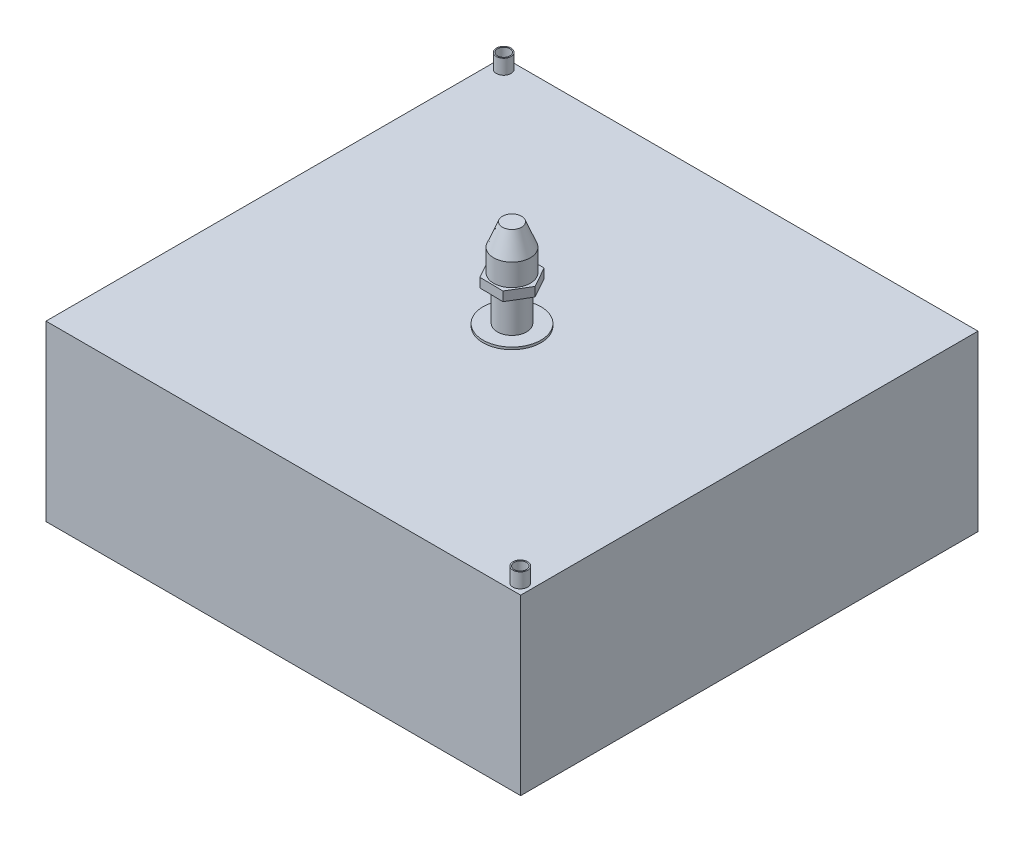
ISO-10303-21;
HEADER;
FILE_DESCRIPTION(('STEP AP214'),'2;1');
FILE_NAME('part.step','',(''),(''),'','','');
FILE_SCHEMA(('AUTOMOTIVE_DESIGN { 1 0 10303 214 1 1 1 1 }'));
ENDSEC;
DATA;
#1=APPLICATION_CONTEXT('core data for automotive mechanical design processes');
#2=APPLICATION_PROTOCOL_DEFINITION('international standard','automotive_design',2000,#1);
#3=PRODUCT_CONTEXT('',#1,'mechanical');
#4=PRODUCT('Part','Part','',(#3));
#5=PRODUCT_RELATED_PRODUCT_CATEGORY('part','',(#4));
#6=PRODUCT_DEFINITION_FORMATION('','',#4);
#7=PRODUCT_DEFINITION_CONTEXT('part definition',#1,'design');
#8=PRODUCT_DEFINITION('design','',#6,#7);
#9=PRODUCT_DEFINITION_SHAPE('','',#8);
#10=(LENGTH_UNIT() NAMED_UNIT(*) SI_UNIT(.MILLI.,.METRE.));
#11=(NAMED_UNIT(*) PLANE_ANGLE_UNIT() SI_UNIT($,.RADIAN.));
#12=(NAMED_UNIT(*) SI_UNIT($,.STERADIAN.) SOLID_ANGLE_UNIT());
#13=UNCERTAINTY_MEASURE_WITH_UNIT(LENGTH_MEASURE(1.E-05),#10,'distance_accuracy_value','');
#14=(GEOMETRIC_REPRESENTATION_CONTEXT(3) GLOBAL_UNCERTAINTY_ASSIGNED_CONTEXT((#13)) GLOBAL_UNIT_ASSIGNED_CONTEXT((#10,
#11,#12)) REPRESENTATION_CONTEXT('',''));
#15=CARTESIAN_POINT('',(0.,0.,0.));
#16=DIRECTION('',(0.,0.,1.));
#17=DIRECTION('',(1.,0.,0.));
#18=AXIS2_PLACEMENT_3D('',#15,#16,#17);
#19=CARTESIAN_POINT('',(0.,152.,0.));
#20=DIRECTION('',(0.,1.,0.));
#21=DIRECTION('',(0.,0.,1.));
#22=AXIS2_PLACEMENT_3D('',#19,#20,#21);
#23=PLANE('',#22);
#24=CARTESIAN_POINT('',(0.,152.,0.));
#25=DIRECTION('',(0.,1.,0.));
#26=DIRECTION('',(0.,0.,1.));
#27=AXIS2_PLACEMENT_3D('',#24,#25,#26);
#28=CIRCLE('',#27,25.);
#29=CARTESIAN_POINT('',(0.,152.,25.));
#30=VERTEX_POINT('',#29);
#31=EDGE_CURVE('E217',#30,#30,#28,.T.);
#32=ORIENTED_EDGE('',*,*,#31,.T.);
#33=EDGE_LOOP('',(#32));
#34=FACE_BOUND('',#33,.T.);
#35=CARTESIAN_POINT('',(0.,152.,0.));
#36=DIRECTION('',(0.,1.,0.));
#37=DIRECTION('',(0.,0.,1.));
#38=AXIS2_PLACEMENT_3D('',#35,#36,#37);
#39=CIRCLE('',#38,12.7);
#40=CARTESIAN_POINT('',(0.,152.,12.7));
#41=VERTEX_POINT('',#40);
#42=EDGE_CURVE('E203',#41,#41,#39,.T.);
#43=ORIENTED_EDGE('',*,*,#42,.F.);
#44=EDGE_LOOP('',(#43));
#45=FACE_BOUND('',#44,.T.);
#46=ADVANCED_FACE('F38',(#34,#45),#23,.T.);
#47=CARTESIAN_POINT('',(-205.,150.,197.5));
#48=DIRECTION('',(0.,-1.,0.));
#49=DIRECTION('',(0.,0.,-1.));
#50=AXIS2_PLACEMENT_3D('',#47,#48,#49);
#51=PLANE('',#50);
#52=CARTESIAN_POINT('',(195.680339288402,150.,188.521302485167));
#53=DIRECTION('',(0.,-1.,0.));
#54=DIRECTION('',(0.,0.,-1.));
#55=AXIS2_PLACEMENT_3D('',#52,#53,#54);
#56=CIRCLE('',#55,6.34999999999999);
#57=CARTESIAN_POINT('',(195.680339288402,150.,182.171302485167));
#58=VERTEX_POINT('',#57);
#59=EDGE_CURVE('E48',#58,#58,#56,.F.);
#60=ORIENTED_EDGE('',*,*,#59,.F.);
#61=EDGE_LOOP('',(#60));
#62=FACE_BOUND('',#61,.T.);
#63=DIRECTION('',(-1.,0.,0.));
#64=VECTOR('',#63,1.);
#65=CARTESIAN_POINT('',(-205.,150.,-197.5));
#66=LINE('',#65,#64);
#67=CARTESIAN_POINT('',(205.,150.,-197.5));
#68=VERTEX_POINT('',#67);
#69=CARTESIAN_POINT('',(-205.,150.,-197.5));
#70=VERTEX_POINT('',#69);
#71=EDGE_CURVE('E85',#68,#70,#66,.T.);
#72=ORIENTED_EDGE('',*,*,#71,.T.);
#73=DIRECTION('',(0.,0.,-1.));
#74=VECTOR('',#73,1.);
#75=CARTESIAN_POINT('',(-205.,150.,197.5));
#76=LINE('',#75,#74);
#77=CARTESIAN_POINT('',(-205.,150.,197.5));
#78=VERTEX_POINT('',#77);
#79=EDGE_CURVE('E296',#78,#70,#76,.T.);
#80=ORIENTED_EDGE('',*,*,#79,.F.);
#81=DIRECTION('',(-1.,0.,0.));
#82=VECTOR('',#81,1.);
#83=CARTESIAN_POINT('',(-205.,150.,197.5));
#84=LINE('',#83,#82);
#85=CARTESIAN_POINT('',(205.,150.,197.5));
#86=VERTEX_POINT('',#85);
#87=EDGE_CURVE('E59',#86,#78,#84,.T.);
#88=ORIENTED_EDGE('',*,*,#87,.F.);
#89=DIRECTION('',(0.,0.,-1.));
#90=VECTOR('',#89,1.);
#91=CARTESIAN_POINT('',(205.,150.,197.5));
#92=LINE('',#91,#90);
#93=EDGE_CURVE('E309',#86,#68,#92,.T.);
#94=ORIENTED_EDGE('',*,*,#93,.T.);
#95=EDGE_LOOP('',(#72,#80,#88,#94));
#96=FACE_BOUND('',#95,.T.);
#97=CARTESIAN_POINT('',(-195.680339288402,150.,-188.521302485167));
#98=DIRECTION('',(0.,-1.,0.));
#99=DIRECTION('',(0.,0.,-1.));
#100=AXIS2_PLACEMENT_3D('',#97,#98,#99);
#101=CIRCLE('',#100,6.34999999999994);
#102=CARTESIAN_POINT('',(-195.680339288402,150.,-194.871302485167));
#103=VERTEX_POINT('',#102);
#104=EDGE_CURVE('E318',#103,#103,#101,.F.);
#105=ORIENTED_EDGE('',*,*,#104,.F.);
#106=EDGE_LOOP('',(#105));
#107=FACE_BOUND('',#106,.T.);
#108=CARTESIAN_POINT('',(0.,150.,0.));
#109=DIRECTION('',(0.,-1.,0.));
#110=DIRECTION('',(0.,0.,-1.));
#111=AXIS2_PLACEMENT_3D('',#108,#109,#110);
#112=CIRCLE('',#111,25.);
#113=CARTESIAN_POINT('',(0.,150.,-25.));
#114=VERTEX_POINT('',#113);
#115=EDGE_CURVE('E11',#114,#114,#112,.F.);
#116=ORIENTED_EDGE('',*,*,#115,.F.);
#117=EDGE_LOOP('',(#116));
#118=FACE_BOUND('',#117,.T.);
#119=ADVANCED_FACE('F326',(#62,#96,#107,#118),#51,.F.);
#120=CARTESIAN_POINT('',(-205.,150.,197.5));
#121=DIRECTION('',(1.,0.,0.));
#122=DIRECTION('',(0.,1.,0.));
#123=AXIS2_PLACEMENT_3D('',#120,#121,#122);
#124=PLANE('',#123);
#125=DIRECTION('',(0.,-1.,0.));
#126=VECTOR('',#125,1.);
#127=CARTESIAN_POINT('',(-205.,150.,-197.5));
#128=LINE('',#127,#126);
#129=CARTESIAN_POINT('',(-205.,0.,-197.5));
#130=VERTEX_POINT('',#129);
#131=EDGE_CURVE('E285',#70,#130,#128,.T.);
#132=ORIENTED_EDGE('',*,*,#131,.T.);
#133=DIRECTION('',(0.,0.,-1.));
#134=VECTOR('',#133,1.);
#135=CARTESIAN_POINT('',(-205.,0.,197.5));
#136=LINE('',#135,#134);
#137=CARTESIAN_POINT('',(-205.,0.,197.5));
#138=VERTEX_POINT('',#137);
#139=EDGE_CURVE('E315',#138,#130,#136,.T.);
#140=ORIENTED_EDGE('',*,*,#139,.F.);
#141=DIRECTION('',(0.,-1.,0.));
#142=VECTOR('',#141,1.);
#143=CARTESIAN_POINT('',(-205.,150.,197.5));
#144=LINE('',#143,#142);
#145=EDGE_CURVE('E286',#78,#138,#144,.T.);
#146=ORIENTED_EDGE('',*,*,#145,.F.);
#147=ORIENTED_EDGE('',*,*,#79,.T.);
#148=EDGE_LOOP('',(#132,#140,#146,#147));
#149=FACE_BOUND('',#148,.T.);
#150=ADVANCED_FACE('F40',(#149),#124,.F.);
#151=CARTESIAN_POINT('',(-205.,0.,197.5));
#152=DIRECTION('',(0.,1.,0.));
#153=DIRECTION('',(0.,0.,1.));
#154=AXIS2_PLACEMENT_3D('',#151,#152,#153);
#155=PLANE('',#154);
#156=DIRECTION('',(1.,0.,0.));
#157=VECTOR('',#156,1.);
#158=CARTESIAN_POINT('',(-205.,0.,-197.5));
#159=LINE('',#158,#157);
#160=CARTESIAN_POINT('',(205.,0.,-197.5));
#161=VERTEX_POINT('',#160);
#162=EDGE_CURVE('E300',#130,#161,#159,.T.);
#163=ORIENTED_EDGE('',*,*,#162,.T.);
#164=DIRECTION('',(0.,0.,-1.));
#165=VECTOR('',#164,1.);
#166=CARTESIAN_POINT('',(205.,0.,197.5));
#167=LINE('',#166,#165);
#168=CARTESIAN_POINT('',(205.,0.,197.5));
#169=VERTEX_POINT('',#168);
#170=EDGE_CURVE('E312',#169,#161,#167,.T.);
#171=ORIENTED_EDGE('',*,*,#170,.F.);
#172=DIRECTION('',(1.,0.,0.));
#173=VECTOR('',#172,1.);
#174=CARTESIAN_POINT('',(-205.,0.,197.5));
#175=LINE('',#174,#173);
#176=EDGE_CURVE('E95',#138,#169,#175,.T.);
#177=ORIENTED_EDGE('',*,*,#176,.F.);
#178=ORIENTED_EDGE('',*,*,#139,.T.);
#179=EDGE_LOOP('',(#163,#171,#177,#178));
#180=FACE_BOUND('',#179,.T.);
#181=ADVANCED_FACE('F664',(#180),#155,.F.);
#182=CARTESIAN_POINT('',(205.,150.,197.5));
#183=DIRECTION('',(-1.,0.,0.));
#184=DIRECTION('',(0.,-1.,0.));
#185=AXIS2_PLACEMENT_3D('',#182,#183,#184);
#186=PLANE('',#185);
#187=DIRECTION('',(0.,1.,0.));
#188=VECTOR('',#187,1.);
#189=CARTESIAN_POINT('',(205.,150.,-197.5));
#190=LINE('',#189,#188);
#191=EDGE_CURVE('E79',#161,#68,#190,.T.);
#192=ORIENTED_EDGE('',*,*,#191,.T.);
#193=ORIENTED_EDGE('',*,*,#93,.F.);
#194=DIRECTION('',(0.,1.,0.));
#195=VECTOR('',#194,1.);
#196=CARTESIAN_POINT('',(205.,150.,197.5));
#197=LINE('',#196,#195);
#198=EDGE_CURVE('E291',#169,#86,#197,.T.);
#199=ORIENTED_EDGE('',*,*,#198,.F.);
#200=ORIENTED_EDGE('',*,*,#170,.T.);
#201=EDGE_LOOP('',(#192,#193,#199,#200));
#202=FACE_BOUND('',#201,.T.);
#203=ADVANCED_FACE('F670',(#202),#186,.F.);
#204=CARTESIAN_POINT('',(-205.,0.,197.5));
#205=DIRECTION('',(0.,0.,1.));
#206=DIRECTION('',(1.,0.,0.));
#207=AXIS2_PLACEMENT_3D('',#204,#205,#206);
#208=PLANE('',#207);
#209=ORIENTED_EDGE('',*,*,#145,.T.);
#210=ORIENTED_EDGE('',*,*,#176,.T.);
#211=ORIENTED_EDGE('',*,*,#198,.T.);
#212=ORIENTED_EDGE('',*,*,#87,.T.);
#213=EDGE_LOOP('',(#209,#210,#211,#212));
#214=FACE_BOUND('',#213,.T.);
#215=ADVANCED_FACE('F675',(#214),#208,.T.);
#216=CARTESIAN_POINT('',(-205.,0.,-197.5));
#217=DIRECTION('',(0.,0.,1.));
#218=DIRECTION('',(1.,0.,0.));
#219=AXIS2_PLACEMENT_3D('',#216,#217,#218);
#220=PLANE('',#219);
#221=ORIENTED_EDGE('',*,*,#131,.F.);
#222=ORIENTED_EDGE('',*,*,#71,.F.);
#223=ORIENTED_EDGE('',*,*,#191,.F.);
#224=ORIENTED_EDGE('',*,*,#162,.F.);
#225=EDGE_LOOP('',(#221,#222,#223,#224));
#226=FACE_BOUND('',#225,.T.);
#227=ADVANCED_FACE('F680',(#226),#220,.F.);
#228=CARTESIAN_POINT('',(-195.680339288402,162.7,-188.521302485167));
#229=DIRECTION('',(0.,-1.,0.));
#230=DIRECTION('',(0.,0.,-1.));
#231=AXIS2_PLACEMENT_3D('',#228,#229,#230);
#232=CYLINDRICAL_SURFACE('',#231,6.34999999999994);
#233=CARTESIAN_POINT('',(-195.680339288402,162.7,-188.521302485167));
#234=DIRECTION('',(0.,1.,0.));
#235=DIRECTION('',(0.,0.,1.));
#236=AXIS2_PLACEMENT_3D('',#233,#234,#235);
#237=CIRCLE('',#236,6.34999999999994);
#238=CARTESIAN_POINT('',(-195.680339288402,162.7,-182.171302485167));
#239=VERTEX_POINT('',#238);
#240=EDGE_CURVE('E282',#239,#239,#237,.T.);
#241=ORIENTED_EDGE('',*,*,#240,.F.);
#242=EDGE_LOOP('',(#241));
#243=FACE_BOUND('',#242,.T.);
#244=ORIENTED_EDGE('',*,*,#104,.T.);
#245=EDGE_LOOP('',(#244));
#246=FACE_BOUND('',#245,.T.);
#247=ADVANCED_FACE('F685',(#243,#246),#232,.T.);
#248=CARTESIAN_POINT('',(-195.680339288402,162.7,-188.521302485167));
#249=DIRECTION('',(0.,1.,0.));
#250=DIRECTION('',(0.,0.,1.));
#251=AXIS2_PLACEMENT_3D('',#248,#249,#250);
#252=PLANE('',#251);
#253=CARTESIAN_POINT('',(-195.680339288402,162.7,-188.521302485167));
#254=DIRECTION('',(0.,1.,0.));
#255=DIRECTION('',(0.,0.,1.));
#256=AXIS2_PLACEMENT_3D('',#253,#254,#255);
#257=CIRCLE('',#256,5.34999999999994);
#258=CARTESIAN_POINT('',(-195.680339288402,162.7,-183.171302485167));
#259=VERTEX_POINT('',#258);
#260=EDGE_CURVE('E255',#259,#259,#257,.T.);
#261=ORIENTED_EDGE('',*,*,#260,.F.);
#262=EDGE_LOOP('',(#261));
#263=FACE_BOUND('',#262,.T.);
#264=ORIENTED_EDGE('',*,*,#240,.T.);
#265=EDGE_LOOP('',(#264));
#266=FACE_BOUND('',#265,.T.);
#267=ADVANCED_FACE('F520',(#263,#266),#252,.T.);
#268=CARTESIAN_POINT('',(195.680339288402,162.7,188.521302485167));
#269=DIRECTION('',(0.,-1.,0.));
#270=DIRECTION('',(0.,0.,-1.));
#271=AXIS2_PLACEMENT_3D('',#268,#269,#270);
#272=CYLINDRICAL_SURFACE('',#271,6.34999999999999);
#273=CARTESIAN_POINT('',(195.680339288402,162.7,188.521302485167));
#274=DIRECTION('',(0.,1.,0.));
#275=DIRECTION('',(0.,0.,1.));
#276=AXIS2_PLACEMENT_3D('',#273,#274,#275);
#277=CIRCLE('',#276,6.34999999999999);
#278=CARTESIAN_POINT('',(195.680339288402,162.7,194.871302485167));
#279=VERTEX_POINT('',#278);
#280=EDGE_CURVE('E249',#279,#279,#277,.T.);
#281=ORIENTED_EDGE('',*,*,#280,.F.);
#282=EDGE_LOOP('',(#281));
#283=FACE_BOUND('',#282,.T.);
#284=ORIENTED_EDGE('',*,*,#59,.T.);
#285=EDGE_LOOP('',(#284));
#286=FACE_BOUND('',#285,.T.);
#287=ADVANCED_FACE('F324',(#283,#286),#272,.T.);
#288=CARTESIAN_POINT('',(195.680339288402,162.7,188.521302485167));
#289=DIRECTION('',(0.,1.,0.));
#290=DIRECTION('',(0.,0.,1.));
#291=AXIS2_PLACEMENT_3D('',#288,#289,#290);
#292=PLANE('',#291);
#293=CARTESIAN_POINT('',(195.680339288402,162.7,188.521302485167));
#294=DIRECTION('',(0.,1.,0.));
#295=DIRECTION('',(0.,0.,1.));
#296=AXIS2_PLACEMENT_3D('',#293,#294,#295);
#297=CIRCLE('',#296,5.34999999999999);
#298=CARTESIAN_POINT('',(195.680339288402,162.7,193.871302485167));
#299=VERTEX_POINT('',#298);
#300=EDGE_CURVE('E222',#299,#299,#297,.T.);
#301=ORIENTED_EDGE('',*,*,#300,.F.);
#302=EDGE_LOOP('',(#301));
#303=FACE_BOUND('',#302,.T.);
#304=ORIENTED_EDGE('',*,*,#280,.T.);
#305=EDGE_LOOP('',(#304));
#306=FACE_BOUND('',#305,.T.);
#307=ADVANCED_FACE('F519',(#303,#306),#292,.T.);
#308=CARTESIAN_POINT('',(-205.,149.,197.5));
#309=DIRECTION('',(0.,-1.,0.));
#310=DIRECTION('',(0.,0.,-1.));
#311=AXIS2_PLACEMENT_3D('',#308,#309,#310);
#312=PLANE('',#311);
#313=CARTESIAN_POINT('',(-195.680339288402,149.,-188.521302485167));
#314=DIRECTION('',(0.,-1.,0.));
#315=DIRECTION('',(0.,0.,-1.));
#316=AXIS2_PLACEMENT_3D('',#313,#314,#315);
#317=CIRCLE('',#316,5.34999999999994);
#318=CARTESIAN_POINT('',(-195.680339288402,149.,-193.871302485167));
#319=VERTEX_POINT('',#318);
#320=EDGE_CURVE('E223',#319,#319,#317,.F.);
#321=ORIENTED_EDGE('',*,*,#320,.T.);
#322=EDGE_LOOP('',(#321));
#323=FACE_BOUND('',#322,.T.);
#324=DIRECTION('',(-1.,0.,0.));
#325=VECTOR('',#324,1.);
#326=CARTESIAN_POINT('',(-205.,149.,-196.5));
#327=LINE('',#326,#325);
#328=CARTESIAN_POINT('',(204.,149.,-196.5));
#329=VERTEX_POINT('',#328);
#330=CARTESIAN_POINT('',(-204.,149.,-196.5));
#331=VERTEX_POINT('',#330);
#332=EDGE_CURVE('E228',#329,#331,#327,.T.);
#333=ORIENTED_EDGE('',*,*,#332,.F.);
#334=DIRECTION('',(0.,0.,-1.));
#335=VECTOR('',#334,1.);
#336=CARTESIAN_POINT('',(204.,149.,197.5));
#337=LINE('',#336,#335);
#338=CARTESIAN_POINT('',(204.,149.,196.5));
#339=VERTEX_POINT('',#338);
#340=EDGE_CURVE('E237',#339,#329,#337,.T.);
#341=ORIENTED_EDGE('',*,*,#340,.F.);
#342=DIRECTION('',(-1.,0.,0.));
#343=VECTOR('',#342,1.);
#344=CARTESIAN_POINT('',(-205.,149.,196.5));
#345=LINE('',#344,#343);
#346=CARTESIAN_POINT('',(-204.,149.,196.5));
#347=VERTEX_POINT('',#346);
#348=EDGE_CURVE('E238',#339,#347,#345,.T.);
#349=ORIENTED_EDGE('',*,*,#348,.T.);
#350=DIRECTION('',(0.,0.,-1.));
#351=VECTOR('',#350,1.);
#352=CARTESIAN_POINT('',(-204.,149.,197.5));
#353=LINE('',#352,#351);
#354=EDGE_CURVE('E233',#347,#331,#353,.T.);
#355=ORIENTED_EDGE('',*,*,#354,.T.);
#356=EDGE_LOOP('',(#333,#341,#349,#355));
#357=FACE_BOUND('',#356,.T.);
#358=CARTESIAN_POINT('',(195.680339288402,149.,188.521302485167));
#359=DIRECTION('',(0.,-1.,0.));
#360=DIRECTION('',(0.,0.,-1.));
#361=AXIS2_PLACEMENT_3D('',#358,#359,#360);
#362=CIRCLE('',#361,5.34999999999999);
#363=CARTESIAN_POINT('',(195.680339288402,149.,183.171302485167));
#364=VERTEX_POINT('',#363);
#365=EDGE_CURVE('E226',#364,#364,#362,.F.);
#366=ORIENTED_EDGE('',*,*,#365,.T.);
#367=EDGE_LOOP('',(#366));
#368=FACE_BOUND('',#367,.T.);
#369=ADVANCED_FACE('F579',(#323,#357,#368),#312,.T.);
#370=CARTESIAN_POINT('',(-204.,150.,197.5));
#371=DIRECTION('',(1.,0.,0.));
#372=DIRECTION('',(0.,1.,0.));
#373=AXIS2_PLACEMENT_3D('',#370,#371,#372);
#374=PLANE('',#373);
#375=DIRECTION('',(0.,-1.,0.));
#376=VECTOR('',#375,1.);
#377=CARTESIAN_POINT('',(-204.,150.,-196.5));
#378=LINE('',#377,#376);
#379=CARTESIAN_POINT('',(-204.,1.,-196.5));
#380=VERTEX_POINT('',#379);
#381=EDGE_CURVE('E250',#331,#380,#378,.T.);
#382=ORIENTED_EDGE('',*,*,#381,.F.);
#383=ORIENTED_EDGE('',*,*,#354,.F.);
#384=DIRECTION('',(0.,-1.,0.));
#385=VECTOR('',#384,1.);
#386=CARTESIAN_POINT('',(-204.,150.,196.5));
#387=LINE('',#386,#385);
#388=CARTESIAN_POINT('',(-204.,1.,196.5));
#389=VERTEX_POINT('',#388);
#390=EDGE_CURVE('E231',#347,#389,#387,.T.);
#391=ORIENTED_EDGE('',*,*,#390,.T.);
#392=DIRECTION('',(0.,0.,-1.));
#393=VECTOR('',#392,1.);
#394=CARTESIAN_POINT('',(-204.,1.,197.5));
#395=LINE('',#394,#393);
#396=EDGE_CURVE('E227',#389,#380,#395,.T.);
#397=ORIENTED_EDGE('',*,*,#396,.T.);
#398=EDGE_LOOP('',(#382,#383,#391,#397));
#399=FACE_BOUND('',#398,.T.);
#400=ADVANCED_FACE('F571',(#399),#374,.T.);
#401=CARTESIAN_POINT('',(-205.,1.,197.5));
#402=DIRECTION('',(0.,1.,0.));
#403=DIRECTION('',(0.,0.,1.));
#404=AXIS2_PLACEMENT_3D('',#401,#402,#403);
#405=PLANE('',#404);
#406=DIRECTION('',(1.,0.,0.));
#407=VECTOR('',#406,1.);
#408=CARTESIAN_POINT('',(-205.,1.,-196.5));
#409=LINE('',#408,#407);
#410=CARTESIAN_POINT('',(204.,1.,-196.5));
#411=VERTEX_POINT('',#410);
#412=EDGE_CURVE('E254',#380,#411,#409,.T.);
#413=ORIENTED_EDGE('',*,*,#412,.F.);
#414=ORIENTED_EDGE('',*,*,#396,.F.);
#415=DIRECTION('',(1.,0.,0.));
#416=VECTOR('',#415,1.);
#417=CARTESIAN_POINT('',(-205.,1.,196.5));
#418=LINE('',#417,#416);
#419=CARTESIAN_POINT('',(204.,1.,196.5));
#420=VERTEX_POINT('',#419);
#421=EDGE_CURVE('E262',#389,#420,#418,.T.);
#422=ORIENTED_EDGE('',*,*,#421,.T.);
#423=DIRECTION('',(0.,0.,-1.));
#424=VECTOR('',#423,1.);
#425=CARTESIAN_POINT('',(204.,1.,197.5));
#426=LINE('',#425,#424);
#427=EDGE_CURVE('E245',#420,#411,#426,.T.);
#428=ORIENTED_EDGE('',*,*,#427,.T.);
#429=EDGE_LOOP('',(#413,#414,#422,#428));
#430=FACE_BOUND('',#429,.T.);
#431=ADVANCED_FACE('F563',(#430),#405,.T.);
#432=CARTESIAN_POINT('',(204.,150.,197.5));
#433=DIRECTION('',(-1.,0.,0.));
#434=DIRECTION('',(0.,-1.,0.));
#435=AXIS2_PLACEMENT_3D('',#432,#433,#434);
#436=PLANE('',#435);
#437=DIRECTION('',(0.,1.,0.));
#438=VECTOR('',#437,1.);
#439=CARTESIAN_POINT('',(204.,150.,-196.5));
#440=LINE('',#439,#438);
#441=EDGE_CURVE('E232',#411,#329,#440,.T.);
#442=ORIENTED_EDGE('',*,*,#441,.F.);
#443=ORIENTED_EDGE('',*,*,#427,.F.);
#444=DIRECTION('',(0.,1.,0.));
#445=VECTOR('',#444,1.);
#446=CARTESIAN_POINT('',(204.,150.,196.5));
#447=LINE('',#446,#445);
#448=EDGE_CURVE('E241',#420,#339,#447,.T.);
#449=ORIENTED_EDGE('',*,*,#448,.T.);
#450=ORIENTED_EDGE('',*,*,#340,.T.);
#451=EDGE_LOOP('',(#442,#443,#449,#450));
#452=FACE_BOUND('',#451,.T.);
#453=ADVANCED_FACE('F555',(#452),#436,.T.);
#454=CARTESIAN_POINT('',(-205.,0.,196.5));
#455=DIRECTION('',(0.,0.,1.));
#456=DIRECTION('',(1.,0.,0.));
#457=AXIS2_PLACEMENT_3D('',#454,#455,#456);
#458=PLANE('',#457);
#459=ORIENTED_EDGE('',*,*,#390,.F.);
#460=ORIENTED_EDGE('',*,*,#348,.F.);
#461=ORIENTED_EDGE('',*,*,#448,.F.);
#462=ORIENTED_EDGE('',*,*,#421,.F.);
#463=EDGE_LOOP('',(#459,#460,#461,#462));
#464=FACE_BOUND('',#463,.T.);
#465=ADVANCED_FACE('F548',(#464),#458,.F.);
#466=CARTESIAN_POINT('',(-205.,0.,-196.5));
#467=DIRECTION('',(0.,0.,1.));
#468=DIRECTION('',(1.,0.,0.));
#469=AXIS2_PLACEMENT_3D('',#466,#467,#468);
#470=PLANE('',#469);
#471=ORIENTED_EDGE('',*,*,#381,.T.);
#472=ORIENTED_EDGE('',*,*,#412,.T.);
#473=ORIENTED_EDGE('',*,*,#441,.T.);
#474=ORIENTED_EDGE('',*,*,#332,.T.);
#475=EDGE_LOOP('',(#471,#472,#473,#474));
#476=FACE_BOUND('',#475,.T.);
#477=ADVANCED_FACE('F539',(#476),#470,.T.);
#478=CARTESIAN_POINT('',(-195.680339288402,162.7,-188.521302485167));
#479=DIRECTION('',(0.,-1.,0.));
#480=DIRECTION('',(0.,0.,-1.));
#481=AXIS2_PLACEMENT_3D('',#478,#479,#480);
#482=CYLINDRICAL_SURFACE('',#481,5.34999999999994);
#483=ORIENTED_EDGE('',*,*,#260,.T.);
#484=EDGE_LOOP('',(#483));
#485=FACE_BOUND('',#484,.T.);
#486=ORIENTED_EDGE('',*,*,#320,.F.);
#487=EDGE_LOOP('',(#486));
#488=FACE_BOUND('',#487,.T.);
#489=ADVANCED_FACE('F347',(#485,#488),#482,.F.);
#490=CARTESIAN_POINT('',(195.680339288402,162.7,188.521302485167));
#491=DIRECTION('',(0.,-1.,0.));
#492=DIRECTION('',(0.,0.,-1.));
#493=AXIS2_PLACEMENT_3D('',#490,#491,#492);
#494=CYLINDRICAL_SURFACE('',#493,5.34999999999999);
#495=ORIENTED_EDGE('',*,*,#300,.T.);
#496=EDGE_LOOP('',(#495));
#497=FACE_BOUND('',#496,.T.);
#498=ORIENTED_EDGE('',*,*,#365,.F.);
#499=EDGE_LOOP('',(#498));
#500=FACE_BOUND('',#499,.T.);
#501=ADVANCED_FACE('F337',(#497,#500),#494,.F.);
#502=CARTESIAN_POINT('',(0.,152.,0.));
#503=DIRECTION('',(0.,-1.,0.));
#504=DIRECTION('',(0.,0.,-1.));
#505=AXIS2_PLACEMENT_3D('',#502,#503,#504);
#506=CYLINDRICAL_SURFACE('',#505,25.);
#507=ORIENTED_EDGE('',*,*,#31,.F.);
#508=EDGE_LOOP('',(#507));
#509=FACE_BOUND('',#508,.T.);
#510=ORIENTED_EDGE('',*,*,#115,.T.);
#511=EDGE_LOOP('',(#510));
#512=FACE_BOUND('',#511,.T.);
#513=ADVANCED_FACE('F334',(#509,#512),#506,.T.);
#514=CARTESIAN_POINT('',(0.,182.,0.));
#515=DIRECTION('',(0.,-1.,0.));
#516=DIRECTION('',(0.,0.,-1.));
#517=AXIS2_PLACEMENT_3D('',#514,#515,#516);
#518=CYLINDRICAL_SURFACE('',#517,12.7);
#519=CARTESIAN_POINT('',(0.,182.,0.));
#520=DIRECTION('',(0.,1.,0.));
#521=DIRECTION('',(0.,0.,1.));
#522=AXIS2_PLACEMENT_3D('',#519,#520,#521);
#523=CIRCLE('',#522,12.7);
#524=CARTESIAN_POINT('',(0.,182.,12.7));
#525=VERTEX_POINT('',#524);
#526=EDGE_CURVE('E208',#525,#525,#523,.T.);
#527=ORIENTED_EDGE('',*,*,#526,.F.);
#528=EDGE_LOOP('',(#527));
#529=FACE_BOUND('',#528,.T.);
#530=ORIENTED_EDGE('',*,*,#42,.T.);
#531=EDGE_LOOP('',(#530));
#532=FACE_BOUND('',#531,.T.);
#533=ADVANCED_FACE('F336',(#529,#532),#518,.T.);
#534=CARTESIAN_POINT('',(20.2044008005971,182.,0.339884718935427));
#535=DIRECTION('',(0.,-1.,0.));
#536=DIRECTION('',(0.,0.,-1.));
#537=AXIS2_PLACEMENT_3D('',#534,#535,#536);
#538=PLANE('',#537);
#539=DIRECTION('',(-0.485362779518759,0.,-0.874312857195766));
#540=VECTOR('',#539,1.);
#541=CARTESIAN_POINT('',(20.2044008005971,182.,0.339884718935429));
#542=LINE('',#541,#540);
#543=CARTESIAN_POINT('',(20.2044008005971,182.,0.339884718935429));
#544=VERTEX_POINT('',#543);
#545=CARTESIAN_POINT('',(10.3965492012547,182.,-17.327582002092));
#546=VERTEX_POINT('',#545);
#547=EDGE_CURVE('E201',#544,#546,#542,.T.);
#548=ORIENTED_EDGE('',*,*,#547,.F.);
#549=DIRECTION('',(0.51449575542751,0.,-0.857492925712554));
#550=VECTOR('',#549,1.);
#551=CARTESIAN_POINT('',(9.80785159934232,182.,17.6674667210274));
#552=LINE('',#551,#550);
#553=CARTESIAN_POINT('',(9.80785159934232,182.,17.6674667210274));
#554=VERTEX_POINT('',#553);
#555=EDGE_CURVE('E197',#554,#544,#552,.T.);
#556=ORIENTED_EDGE('',*,*,#555,.F.);
#557=DIRECTION('',(0.999858534946269,0.,0.016819931483212));
#558=VECTOR('',#557,1.);
#559=CARTESIAN_POINT('',(-10.3965492012547,182.,17.327582002092));
#560=LINE('',#559,#558);
#561=CARTESIAN_POINT('',(-10.3965492012547,182.,17.327582002092));
#562=VERTEX_POINT('',#561);
#563=EDGE_CURVE('E433',#562,#554,#560,.T.);
#564=ORIENTED_EDGE('',*,*,#563,.F.);
#565=DIRECTION('',(0.485362779518759,0.,0.874312857195766));
#566=VECTOR('',#565,1.);
#567=CARTESIAN_POINT('',(-20.2044008005971,182.,-0.339884718935431));
#568=LINE('',#567,#566);
#569=CARTESIAN_POINT('',(-20.2044008005971,182.,-0.339884718935431));
#570=VERTEX_POINT('',#569);
#571=EDGE_CURVE('E430',#570,#562,#568,.T.);
#572=ORIENTED_EDGE('',*,*,#571,.F.);
#573=DIRECTION('',(-0.51449575542751,0.,0.857492925712554));
#574=VECTOR('',#573,1.);
#575=CARTESIAN_POINT('',(-9.80785159934231,182.,-17.6674667210274));
#576=LINE('',#575,#574);
#577=CARTESIAN_POINT('',(-9.80785159934231,182.,-17.6674667210274));
#578=VERTEX_POINT('',#577);
#579=EDGE_CURVE('E427',#578,#570,#576,.T.);
#580=ORIENTED_EDGE('',*,*,#579,.F.);
#581=DIRECTION('',(-0.999858534946269,0.,-0.0168199314832124));
#582=VECTOR('',#581,1.);
#583=CARTESIAN_POINT('',(10.3965492012547,182.,-17.327582002092));
#584=LINE('',#583,#582);
#585=EDGE_CURVE('E425',#546,#578,#584,.T.);
#586=ORIENTED_EDGE('',*,*,#585,.F.);
#587=EDGE_LOOP('',(#548,#556,#564,#572,#580,#586));
#588=FACE_BOUND('',#587,.T.);
#589=ORIENTED_EDGE('',*,*,#526,.T.);
#590=EDGE_LOOP('',(#589));
#591=FACE_BOUND('',#590,.T.);
#592=ADVANCED_FACE('F344',(#588,#591),#538,.T.);
#593=CARTESIAN_POINT('',(20.2044008005971,190.,0.339884718935429));
#594=DIRECTION('',(-0.874312857195766,0.,0.48536277951876));
#595=DIRECTION('',(0.48536277951876,0.,0.874312857195766));
#596=AXIS2_PLACEMENT_3D('',#593,#594,#595);
#597=PLANE('',#596);
#598=ORIENTED_EDGE('',*,*,#547,.T.);
#599=DIRECTION('',(0.,-1.,0.));
#600=VECTOR('',#599,1.);
#601=CARTESIAN_POINT('',(10.3965492012547,190.,-17.327582002092));
#602=LINE('',#601,#600);
#603=CARTESIAN_POINT('',(10.3965492012547,190.,-17.327582002092));
#604=VERTEX_POINT('',#603);
#605=EDGE_CURVE('E179',#604,#546,#602,.T.);
#606=ORIENTED_EDGE('',*,*,#605,.F.);
#607=DIRECTION('',(-0.485362779518759,0.,-0.874312857195766));
#608=VECTOR('',#607,1.);
#609=CARTESIAN_POINT('',(20.2044008005971,190.,0.339884718935429));
#610=LINE('',#609,#608);
#611=CARTESIAN_POINT('',(20.2044008005971,190.,0.339884718935429));
#612=VERTEX_POINT('',#611);
#613=EDGE_CURVE('E187',#612,#604,#610,.T.);
#614=ORIENTED_EDGE('',*,*,#613,.F.);
#615=DIRECTION('',(0.,-1.,0.));
#616=VECTOR('',#615,1.);
#617=CARTESIAN_POINT('',(20.2044008005971,190.,0.339884718935429));
#618=LINE('',#617,#616);
#619=EDGE_CURVE('E422',#612,#544,#618,.T.);
#620=ORIENTED_EDGE('',*,*,#619,.T.);
#621=EDGE_LOOP('',(#598,#606,#614,#620));
#622=FACE_BOUND('',#621,.T.);
#623=ADVANCED_FACE('F199',(#622),#597,.F.);
#624=CARTESIAN_POINT('',(10.3965492012547,190.,-17.327582002092));
#625=DIRECTION('',(-0.0168199314832124,0.,0.999858534946269));
#626=DIRECTION('',(0.999858534946269,0.,0.0168199314832124));
#627=AXIS2_PLACEMENT_3D('',#624,#625,#626);
#628=PLANE('',#627);
#629=ORIENTED_EDGE('',*,*,#585,.T.);
#630=DIRECTION('',(0.,-1.,0.));
#631=VECTOR('',#630,1.);
#632=CARTESIAN_POINT('',(-9.80785159934231,190.,-17.6674667210274));
#633=LINE('',#632,#631);
#634=CARTESIAN_POINT('',(-9.80785159934231,190.,-17.6674667210274));
#635=VERTEX_POINT('',#634);
#636=EDGE_CURVE('E182',#635,#578,#633,.T.);
#637=ORIENTED_EDGE('',*,*,#636,.F.);
#638=DIRECTION('',(-0.999858534946269,0.,-0.0168199314832124));
#639=VECTOR('',#638,1.);
#640=CARTESIAN_POINT('',(10.3965492012547,190.,-17.327582002092));
#641=LINE('',#640,#639);
#642=EDGE_CURVE('E175',#604,#635,#641,.T.);
#643=ORIENTED_EDGE('',*,*,#642,.F.);
#644=ORIENTED_EDGE('',*,*,#605,.T.);
#645=EDGE_LOOP('',(#629,#637,#643,#644));
#646=FACE_BOUND('',#645,.T.);
#647=ADVANCED_FACE('F177',(#646),#628,.F.);
#648=CARTESIAN_POINT('',(-9.80785159934231,190.,-17.6674667210274));
#649=DIRECTION('',(0.857492925712554,0.,0.51449575542751));
#650=DIRECTION('',(0.51449575542751,0.,-0.857492925712554));
#651=AXIS2_PLACEMENT_3D('',#648,#649,#650);
#652=PLANE('',#651);
#653=ORIENTED_EDGE('',*,*,#579,.T.);
#654=DIRECTION('',(0.,-1.,0.));
#655=VECTOR('',#654,1.);
#656=CARTESIAN_POINT('',(-20.2044008005971,190.,-0.339884718935431));
#657=LINE('',#656,#655);
#658=CARTESIAN_POINT('',(-20.2044008005971,190.,-0.339884718935431));
#659=VERTEX_POINT('',#658);
#660=EDGE_CURVE('E211',#659,#570,#657,.T.);
#661=ORIENTED_EDGE('',*,*,#660,.F.);
#662=DIRECTION('',(-0.51449575542751,0.,0.857492925712554));
#663=VECTOR('',#662,1.);
#664=CARTESIAN_POINT('',(-9.80785159934231,190.,-17.6674667210274));
#665=LINE('',#664,#663);
#666=EDGE_CURVE('E186',#635,#659,#665,.T.);
#667=ORIENTED_EDGE('',*,*,#666,.F.);
#668=ORIENTED_EDGE('',*,*,#636,.T.);
#669=EDGE_LOOP('',(#653,#661,#667,#668));
#670=FACE_BOUND('',#669,.T.);
#671=ADVANCED_FACE('F363',(#670),#652,.F.);
#672=CARTESIAN_POINT('',(-20.2044008005971,190.,-0.339884718935431));
#673=DIRECTION('',(0.874312857195766,0.,-0.485362779518759));
#674=DIRECTION('',(-0.485362779518759,0.,-0.874312857195766));
#675=AXIS2_PLACEMENT_3D('',#672,#673,#674);
#676=PLANE('',#675);
#677=ORIENTED_EDGE('',*,*,#571,.T.);
#678=DIRECTION('',(0.,-1.,0.));
#679=VECTOR('',#678,1.);
#680=CARTESIAN_POINT('',(-10.3965492012547,190.,17.327582002092));
#681=LINE('',#680,#679);
#682=CARTESIAN_POINT('',(-10.3965492012547,190.,17.327582002092));
#683=VERTEX_POINT('',#682);
#684=EDGE_CURVE('E444',#683,#562,#681,.T.);
#685=ORIENTED_EDGE('',*,*,#684,.F.);
#686=DIRECTION('',(0.485362779518759,0.,0.874312857195766));
#687=VECTOR('',#686,1.);
#688=CARTESIAN_POINT('',(-20.2044008005971,190.,-0.339884718935431));
#689=LINE('',#688,#687);
#690=EDGE_CURVE('E414',#659,#683,#689,.T.);
#691=ORIENTED_EDGE('',*,*,#690,.F.);
#692=ORIENTED_EDGE('',*,*,#660,.T.);
#693=EDGE_LOOP('',(#677,#685,#691,#692));
#694=FACE_BOUND('',#693,.T.);
#695=ADVANCED_FACE('F366',(#694),#676,.F.);
#696=CARTESIAN_POINT('',(-10.3965492012547,190.,17.327582002092));
#697=DIRECTION('',(0.016819931483212,0.,-0.999858534946269));
#698=DIRECTION('',(-0.999858534946269,0.,-0.016819931483212));
#699=AXIS2_PLACEMENT_3D('',#696,#697,#698);
#700=PLANE('',#699);
#701=ORIENTED_EDGE('',*,*,#563,.T.);
#702=DIRECTION('',(0.,-1.,0.));
#703=VECTOR('',#702,1.);
#704=CARTESIAN_POINT('',(9.80785159934232,190.,17.6674667210274));
#705=LINE('',#704,#703);
#706=CARTESIAN_POINT('',(9.80785159934232,190.,17.6674667210274));
#707=VERTEX_POINT('',#706);
#708=EDGE_CURVE('E440',#707,#554,#705,.T.);
#709=ORIENTED_EDGE('',*,*,#708,.F.);
#710=DIRECTION('',(0.999858534946269,0.,0.016819931483212));
#711=VECTOR('',#710,1.);
#712=CARTESIAN_POINT('',(-10.3965492012547,190.,17.327582002092));
#713=LINE('',#712,#711);
#714=EDGE_CURVE('E417',#683,#707,#713,.T.);
#715=ORIENTED_EDGE('',*,*,#714,.F.);
#716=ORIENTED_EDGE('',*,*,#684,.T.);
#717=EDGE_LOOP('',(#701,#709,#715,#716));
#718=FACE_BOUND('',#717,.T.);
#719=ADVANCED_FACE('F370',(#718),#700,.F.);
#720=CARTESIAN_POINT('',(9.80785159934232,190.,17.6674667210274));
#721=DIRECTION('',(-0.857492925712554,0.,-0.51449575542751));
#722=DIRECTION('',(-0.51449575542751,0.,0.857492925712554));
#723=AXIS2_PLACEMENT_3D('',#720,#721,#722);
#724=PLANE('',#723);
#725=ORIENTED_EDGE('',*,*,#555,.T.);
#726=ORIENTED_EDGE('',*,*,#619,.F.);
#727=DIRECTION('',(0.51449575542751,0.,-0.857492925712554));
#728=VECTOR('',#727,1.);
#729=CARTESIAN_POINT('',(9.80785159934232,190.,17.6674667210274));
#730=LINE('',#729,#728);
#731=EDGE_CURVE('E192',#707,#612,#730,.T.);
#732=ORIENTED_EDGE('',*,*,#731,.F.);
#733=ORIENTED_EDGE('',*,*,#708,.T.);
#734=EDGE_LOOP('',(#725,#726,#732,#733));
#735=FACE_BOUND('',#734,.T.);
#736=ADVANCED_FACE('F374',(#735),#724,.F.);
#737=CARTESIAN_POINT('',(20.2044008005971,190.,0.339884718935427));
#738=DIRECTION('',(0.,-1.,0.));
#739=DIRECTION('',(0.,0.,-1.));
#740=AXIS2_PLACEMENT_3D('',#737,#738,#739);
#741=PLANE('',#740);
#742=CARTESIAN_POINT('',(0.,190.,0.));
#743=DIRECTION('',(0.,-1.,0.));
#744=DIRECTION('',(0.,0.,-1.));
#745=AXIS2_PLACEMENT_3D('',#742,#743,#744);
#746=CIRCLE('',#745,15.875);
#747=CARTESIAN_POINT('',(0.,190.,-15.875));
#748=VERTEX_POINT('',#747);
#749=EDGE_CURVE('E406',#748,#748,#746,.T.);
#750=ORIENTED_EDGE('',*,*,#749,.T.);
#751=EDGE_LOOP('',(#750));
#752=FACE_BOUND('',#751,.T.);
#753=ORIENTED_EDGE('',*,*,#613,.T.);
#754=ORIENTED_EDGE('',*,*,#642,.T.);
#755=ORIENTED_EDGE('',*,*,#666,.T.);
#756=ORIENTED_EDGE('',*,*,#690,.T.);
#757=ORIENTED_EDGE('',*,*,#714,.T.);
#758=ORIENTED_EDGE('',*,*,#731,.T.);
#759=EDGE_LOOP('',(#753,#754,#755,#756,#757,#758));
#760=FACE_BOUND('',#759,.T.);
#761=ADVANCED_FACE('F190',(#752,#760),#741,.F.);
#762=CARTESIAN_POINT('',(0.,0.,0.));
#763=DIRECTION('',(0.,-1.,0.));
#764=DIRECTION('',(0.,0.,-1.));
#765=AXIS2_PLACEMENT_3D('',#762,#763,#764);
#766=CYLINDRICAL_SURFACE('',#765,15.875);
#767=CARTESIAN_POINT('',(0.,209.05,0.));
#768=DIRECTION('',(0.,-1.,0.));
#769=DIRECTION('',(0.,0.,-1.));
#770=AXIS2_PLACEMENT_3D('',#767,#768,#769);
#771=CIRCLE('',#770,15.875);
#772=CARTESIAN_POINT('',(0.,209.05,-15.875));
#773=VERTEX_POINT('',#772);
#774=EDGE_CURVE('E402',#773,#773,#771,.T.);
#775=ORIENTED_EDGE('',*,*,#774,.T.);
#776=EDGE_LOOP('',(#775));
#777=FACE_BOUND('',#776,.T.);
#778=ORIENTED_EDGE('',*,*,#749,.F.);
#779=EDGE_LOOP('',(#778));
#780=FACE_BOUND('',#779,.T.);
#781=ADVANCED_FACE('F384',(#777,#780),#766,.T.);
#782=CARTESIAN_POINT('',(0.,209.05,0.));
#783=DIRECTION('',(0.,-1.,0.));
#784=DIRECTION('',(0.,0.,-1.));
#785=AXIS2_PLACEMENT_3D('',#782,#783,#784);
#786=CONICAL_SURFACE('',#785,15.875,0.380506377112365);
#787=CARTESIAN_POINT('',(0.,228.1,0.));
#788=DIRECTION('',(0.,-1.,0.));
#789=DIRECTION('',(0.,0.,-1.));
#790=AXIS2_PLACEMENT_3D('',#787,#788,#789);
#791=CIRCLE('',#790,8.255);
#792=CARTESIAN_POINT('',(0.,228.1,-8.255));
#793=VERTEX_POINT('',#792);
#794=EDGE_CURVE('E400',#793,#793,#791,.T.);
#795=ORIENTED_EDGE('',*,*,#794,.T.);
#796=EDGE_LOOP('',(#795));
#797=FACE_BOUND('',#796,.T.);
#798=ORIENTED_EDGE('',*,*,#774,.F.);
#799=EDGE_LOOP('',(#798));
#800=FACE_BOUND('',#799,.T.);
#801=ADVANCED_FACE('F388',(#797,#800),#786,.T.);
#802=CARTESIAN_POINT('',(8.255,228.1,0.));
#803=DIRECTION('',(0.,1.,0.));
#804=DIRECTION('',(0.,0.,1.));
#805=AXIS2_PLACEMENT_3D('',#802,#803,#804);
#806=PLANE('',#805);
#807=ORIENTED_EDGE('',*,*,#794,.F.);
#808=EDGE_LOOP('',(#807));
#809=FACE_BOUND('',#808,.T.);
#810=ADVANCED_FACE('F392',(#809),#806,.T.);
#811=CLOSED_SHELL('',(#46,#119,#150,#181,#203,#215,#227,#247,#267,#287,#307,#369,#400,#431,#453,
#465,#477,#489,#501,#513,#533,#592,#623,#647,#671,#695,#719,#736,#761,#781,#801,#810));
#812=MANIFOLD_SOLID_BREP('B2',#811);
#813=ADVANCED_BREP_SHAPE_REPRESENTATION('',(#18,#812),#14);
#814=SHAPE_DEFINITION_REPRESENTATION(#9,#813);
ENDSEC;
END-ISO-10303-21;
